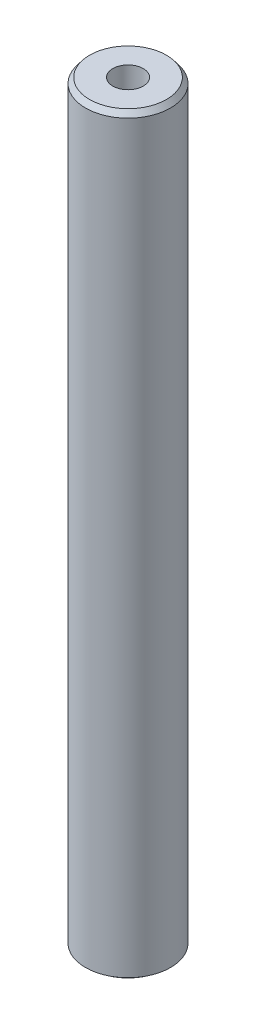
ISO-10303-21;
HEADER;
FILE_DESCRIPTION(('STEP AP214'),'2;1');
FILE_NAME('part.step','',(''),(''),'','','');
FILE_SCHEMA(('AUTOMOTIVE_DESIGN { 1 0 10303 214 1 1 1 1 }'));
ENDSEC;
DATA;
#1=APPLICATION_CONTEXT('core data for automotive mechanical design processes');
#2=APPLICATION_PROTOCOL_DEFINITION('international standard','automotive_design',2000,#1);
#3=PRODUCT_CONTEXT('',#1,'mechanical');
#4=PRODUCT('Part','Part','',(#3));
#5=PRODUCT_RELATED_PRODUCT_CATEGORY('part','',(#4));
#6=PRODUCT_DEFINITION_FORMATION('','',#4);
#7=PRODUCT_DEFINITION_CONTEXT('part definition',#1,'design');
#8=PRODUCT_DEFINITION('design','',#6,#7);
#9=PRODUCT_DEFINITION_SHAPE('','',#8);
#10=(LENGTH_UNIT() NAMED_UNIT(*) SI_UNIT(.MILLI.,.METRE.));
#11=(NAMED_UNIT(*) PLANE_ANGLE_UNIT() SI_UNIT($,.RADIAN.));
#12=(NAMED_UNIT(*) SI_UNIT($,.STERADIAN.) SOLID_ANGLE_UNIT());
#13=UNCERTAINTY_MEASURE_WITH_UNIT(LENGTH_MEASURE(1.E-05),#10,'distance_accuracy_value','');
#14=(GEOMETRIC_REPRESENTATION_CONTEXT(3) GLOBAL_UNCERTAINTY_ASSIGNED_CONTEXT((#13)) GLOBAL_UNIT_ASSIGNED_CONTEXT((#10,
#11,#12)) REPRESENTATION_CONTEXT('',''));
#15=CARTESIAN_POINT('',(0.,0.,0.));
#16=DIRECTION('',(0.,0.,1.));
#17=DIRECTION('',(1.,0.,0.));
#18=AXIS2_PLACEMENT_3D('',#15,#16,#17);
#19=CARTESIAN_POINT('',(0.,310.649268108965,0.));
#20=DIRECTION('',(0.,-1.,0.));
#21=DIRECTION('',(0.,0.,-1.));
#22=AXIS2_PLACEMENT_3D('',#19,#20,#21);
#23=CYLINDRICAL_SURFACE('',#22,17.5);
#24=CARTESIAN_POINT('',(0.,308.43535250962,0.));
#25=DIRECTION('',(0.,1.,0.));
#26=DIRECTION('',(0.,0.,1.));
#27=AXIS2_PLACEMENT_3D('',#24,#25,#26);
#28=CIRCLE('',#27,17.5);
#29=CARTESIAN_POINT('',(0.,308.43535250962,-17.5));
#30=VERTEX_POINT('',#29);
#31=EDGE_CURVE('E50',#30,#30,#28,.F.);
#32=CARTESIAN_POINT('',(0.,1.66145364689391,0.));
#33=DIRECTION('',(0.,1.,0.));
#34=DIRECTION('',(0.,0.,1.));
#35=AXIS2_PLACEMENT_3D('',#32,#33,#34);
#36=CIRCLE('',#35,17.5);
#37=CARTESIAN_POINT('',(0.,1.66145364689391,-17.5));
#38=VERTEX_POINT('',#37);
#39=EDGE_CURVE('E51',#38,#38,#36,.T.);
#40=CARTESIAN_POINT('',(0.,308.43535250962,-17.5));
#41=CARTESIAN_POINT('',(0.,305.239791063133,-17.5));
#42=CARTESIAN_POINT('',(0.,302.044229616646,-17.5));
#43=CARTESIAN_POINT('',(0.,295.653106723673,-17.5));
#44=CARTESIAN_POINT('',(0.,292.457545277186,-17.5));
#45=CARTESIAN_POINT('',(0.,286.066422384213,-17.5));
#46=CARTESIAN_POINT('',(0.,282.870860937726,-17.5));
#47=CARTESIAN_POINT('',(0.,276.479738044752,-17.5));
#48=CARTESIAN_POINT('',(0.,273.284176598266,-17.5));
#49=CARTESIAN_POINT('',(0.,266.893053705292,-17.5));
#50=CARTESIAN_POINT('',(0.,263.697492258805,-17.5));
#51=CARTESIAN_POINT('',(0.,257.306369365832,-17.5));
#52=CARTESIAN_POINT('',(0.,254.110807919345,-17.5));
#53=CARTESIAN_POINT('',(0.,247.719685026372,-17.5));
#54=CARTESIAN_POINT('',(0.,244.524123579885,-17.5));
#55=CARTESIAN_POINT('',(0.,238.133000686912,-17.5));
#56=CARTESIAN_POINT('',(0.,234.937439240425,-17.5));
#57=CARTESIAN_POINT('',(0.,228.546316347452,-17.5));
#58=CARTESIAN_POINT('',(0.,225.350754900965,-17.5));
#59=CARTESIAN_POINT('',(0.,218.959632007991,-17.5));
#60=CARTESIAN_POINT('',(0.,215.764070561505,-17.5));
#61=CARTESIAN_POINT('',(0.,209.372947668531,-17.5));
#62=CARTESIAN_POINT('',(0.,206.177386222044,-17.5));
#63=CARTESIAN_POINT('',(0.,199.786263329071,-17.5));
#64=CARTESIAN_POINT('',(0.,196.590701882584,-17.5));
#65=CARTESIAN_POINT('',(0.,190.199578989611,-17.5));
#66=CARTESIAN_POINT('',(0.,187.004017543124,-17.5));
#67=CARTESIAN_POINT('',(0.,180.612894650151,-17.5));
#68=CARTESIAN_POINT('',(0.,177.417333203664,-17.5));
#69=CARTESIAN_POINT('',(0.,171.02621031069,-17.5));
#70=CARTESIAN_POINT('',(0.,167.830648864204,-17.5));
#71=CARTESIAN_POINT('',(0.,161.43952597123,-17.5));
#72=CARTESIAN_POINT('',(0.,158.243964524744,-17.5));
#73=CARTESIAN_POINT('',(0.,151.85284163177,-17.5));
#74=CARTESIAN_POINT('',(0.,148.657280185283,-17.5));
#75=CARTESIAN_POINT('',(0.,142.26615729231,-17.5));
#76=CARTESIAN_POINT('',(0.,139.070595845823,-17.5));
#77=CARTESIAN_POINT('',(0.,132.67947295285,-17.5));
#78=CARTESIAN_POINT('',(0.,129.483911506363,-17.5));
#79=CARTESIAN_POINT('',(0.,123.09278861339,-17.5));
#80=CARTESIAN_POINT('',(0.,119.897227166903,-17.5));
#81=CARTESIAN_POINT('',(0.,113.506104273929,-17.5));
#82=CARTESIAN_POINT('',(0.,110.310542827443,-17.5));
#83=CARTESIAN_POINT('',(0.,103.919419934469,-17.5));
#84=CARTESIAN_POINT('',(0.,100.723858487982,-17.5));
#85=CARTESIAN_POINT('',(0.,94.332735595009,-17.5));
#86=CARTESIAN_POINT('',(0.,91.1371741485223,-17.5));
#87=CARTESIAN_POINT('',(0.,84.7460512555488,-17.5));
#88=CARTESIAN_POINT('',(0.,81.5504898090621,-17.5));
#89=CARTESIAN_POINT('',(0.,75.1593669160886,-17.5));
#90=CARTESIAN_POINT('',(0.,71.9638054696019,-17.5));
#91=CARTESIAN_POINT('',(0.,65.5726825766285,-17.5));
#92=CARTESIAN_POINT('',(0.,62.3771211301417,-17.5));
#93=CARTESIAN_POINT('',(0.,55.9859982371683,-17.5));
#94=CARTESIAN_POINT('',(0.,52.7904367906816,-17.5));
#95=CARTESIAN_POINT('',(0.,46.3993138977081,-17.5));
#96=CARTESIAN_POINT('',(0.,43.2037524512214,-17.5));
#97=CARTESIAN_POINT('',(0.,36.812629558248,-17.5));
#98=CARTESIAN_POINT('',(0.,33.6170681117612,-17.5));
#99=CARTESIAN_POINT('',(0.,27.2259452187878,-17.5));
#100=CARTESIAN_POINT('',(0.,24.030383772301,-17.5));
#101=CARTESIAN_POINT('',(0.,17.6392608793276,-17.5));
#102=CARTESIAN_POINT('',(0.,14.4436994328408,-17.5));
#103=CARTESIAN_POINT('',(0.,8.05257653986737,-17.5));
#104=CARTESIAN_POINT('',(0.,4.85701509338064,-17.5));
#105=CARTESIAN_POINT('',(0.,1.66145364689391,-17.5));
#106=B_SPLINE_CURVE_WITH_KNOTS('',3,(#40,#41,#42,#43,#44,#45,#46,#47,#48,#49,#50,#51,#52,#53,
#54,#55,#56,#57,#58,#59,#60,#61,#62,#63,#64,#65,#66,#67,#68,#69,#70,#71,#72,#73,#74,#75,#76,#77,
#78,#79,#80,#81,#82,#83,#84,#85,#86,#87,#88,#89,#90,#91,#92,#93,#94,#95,#96,#97,#98,#99,#100,
#101,#102,#103,#104,#105),.UNSPECIFIED.,.F.,.F.,(4,2,2,2,2,2,2,2,2,2,2,2,2,2,2,2,2,2,2,2,2,2,2,
2,2,2,2,2,2,2,2,2,4),(0.,9.5866843394602,19.1733686789204,28.7600530183806,38.3467373578407,
47.9334216973009,57.5201060367611,67.1067903762213,76.6934747156814,86.2801590551416,
95.8668433946018,105.453527734062,115.040212073522,124.626896412982,134.213580752443,
143.800265091903,153.386949431363,162.973633770823,172.560318110283,182.147002449743,
191.733686789204,201.320371128664,210.907055468124,220.493739807584,230.080424147044,
239.667108486505,249.253792825965,258.840477165425,268.427161504885,278.013845844345,
287.600530183805,297.187214523266,306.773898862726),.UNSPECIFIED.);
#107=EDGE_CURVE('BSEAM39',#30,#38,#106,.T.);
#108=ORIENTED_EDGE('',*,*,#31,.T.);
#109=ORIENTED_EDGE('',*,*,#39,.T.);
#110=ORIENTED_EDGE('',*,*,#107,.T.);
#111=ORIENTED_EDGE('',*,*,#107,.F.);
#112=EDGE_LOOP('',(#108,#110,#109,#111));
#113=FACE_BOUND('',#112,.T.);
#114=ADVANCED_FACE('F39',(#113),#23,.T.);
#115=CARTESIAN_POINT('',(0.,310.649268108965,0.));
#116=DIRECTION('',(0.,1.,0.));
#117=DIRECTION('',(0.,0.,1.));
#118=AXIS2_PLACEMENT_3D('',#115,#116,#117);
#119=PLANE('',#118);
#120=CARTESIAN_POINT('',(0.,310.649268108965,0.));
#121=DIRECTION('',(0.,1.,0.));
#122=DIRECTION('',(0.,0.,1.));
#123=AXIS2_PLACEMENT_3D('',#120,#121,#122);
#124=CIRCLE('',#123,15.8385463531065);
#125=CARTESIAN_POINT('',(0.,310.649268108965,15.8385463531065));
#126=VERTEX_POINT('',#125);
#127=EDGE_CURVE('E54',#126,#126,#124,.T.);
#128=ORIENTED_EDGE('',*,*,#127,.T.);
#129=EDGE_LOOP('',(#128));
#130=FACE_BOUND('',#129,.T.);
#131=CARTESIAN_POINT('',(0.,310.649268108965,0.));
#132=DIRECTION('',(0.,1.,0.));
#133=DIRECTION('',(0.,0.,1.));
#134=AXIS2_PLACEMENT_3D('',#131,#132,#133);
#135=CIRCLE('',#134,6.27484759315791);
#136=CARTESIAN_POINT('',(0.,310.649268108965,-6.27484759315791));
#137=VERTEX_POINT('',#136);
#138=EDGE_CURVE('E58',#137,#137,#135,.T.);
#139=ORIENTED_EDGE('',*,*,#138,.F.);
#140=EDGE_LOOP('',(#139));
#141=FACE_BOUND('',#140,.T.);
#142=ADVANCED_FACE('F69',(#130,#141),#119,.T.);
#143=CARTESIAN_POINT('',(0.,0.,0.));
#144=DIRECTION('',(0.,1.,0.));
#145=DIRECTION('',(0.,0.,1.));
#146=AXIS2_PLACEMENT_3D('',#143,#144,#145);
#147=PLANE('',#146);
#148=CARTESIAN_POINT('',(0.,0.,0.));
#149=DIRECTION('',(0.,1.,0.));
#150=DIRECTION('',(0.,0.,1.));
#151=AXIS2_PLACEMENT_3D('',#148,#149,#150);
#152=CIRCLE('',#151,15.2860844006545);
#153=CARTESIAN_POINT('',(0.,0.,15.2860844006545));
#154=VERTEX_POINT('',#153);
#155=EDGE_CURVE('E10',#154,#154,#152,.F.);
#156=ORIENTED_EDGE('',*,*,#155,.T.);
#157=EDGE_LOOP('',(#156));
#158=FACE_BOUND('',#157,.T.);
#159=CARTESIAN_POINT('',(0.,0.,0.));
#160=DIRECTION('',(0.,1.,0.));
#161=DIRECTION('',(0.,0.,1.));
#162=AXIS2_PLACEMENT_3D('',#159,#160,#161);
#163=CIRCLE('',#162,6.27484759315791);
#164=CARTESIAN_POINT('',(0.,0.,-6.27484759315791));
#165=VERTEX_POINT('',#164);
#166=EDGE_CURVE('E63',#165,#165,#163,.T.);
#167=ORIENTED_EDGE('',*,*,#166,.T.);
#168=EDGE_LOOP('',(#167));
#169=FACE_BOUND('',#168,.T.);
#170=ADVANCED_FACE('F75',(#158,#169),#147,.F.);
#171=CARTESIAN_POINT('',(0.,310.649268108965,0.));
#172=DIRECTION('',(0.,-1.,0.));
#173=DIRECTION('',(0.,0.,-1.));
#174=AXIS2_PLACEMENT_3D('',#171,#172,#173);
#175=CYLINDRICAL_SURFACE('',#174,6.27484759315791);
#176=CARTESIAN_POINT('',(0.,310.649268108965,-6.27484759315791));
#177=CARTESIAN_POINT('',(0.,307.41333823283,-6.27484759315791));
#178=CARTESIAN_POINT('',(0.,304.177408356695,-6.27484759315791));
#179=CARTESIAN_POINT('',(0.,297.705548604424,-6.27484759315791));
#180=CARTESIAN_POINT('',(0.,294.469618728289,-6.27484759315791));
#181=CARTESIAN_POINT('',(0.,287.997758976019,-6.27484759315791));
#182=CARTESIAN_POINT('',(0.,284.761829099884,-6.27484759315791));
#183=CARTESIAN_POINT('',(0.,278.289969347614,-6.27484759315791));
#184=CARTESIAN_POINT('',(0.,275.054039471479,-6.27484759315791));
#185=CARTESIAN_POINT('',(0.,268.582179719209,-6.27484759315791));
#186=CARTESIAN_POINT('',(0.,265.346249843074,-6.27484759315791));
#187=CARTESIAN_POINT('',(0.,258.874390090804,-6.27484759315791));
#188=CARTESIAN_POINT('',(0.,255.638460214669,-6.27484759315791));
#189=CARTESIAN_POINT('',(0.,249.166600462399,-6.27484759315791));
#190=CARTESIAN_POINT('',(0.,245.930670586264,-6.27484759315791));
#191=CARTESIAN_POINT('',(0.,239.458810833994,-6.27484759315791));
#192=CARTESIAN_POINT('',(0.,236.222880957859,-6.27484759315791));
#193=CARTESIAN_POINT('',(0.,229.751021205588,-6.27484759315791));
#194=CARTESIAN_POINT('',(0.,226.515091329453,-6.27484759315791));
#195=CARTESIAN_POINT('',(0.,220.043231577183,-6.27484759315791));
#196=CARTESIAN_POINT('',(0.,216.807301701048,-6.27484759315791));
#197=CARTESIAN_POINT('',(0.,210.335441948778,-6.27484759315791));
#198=CARTESIAN_POINT('',(0.,207.099512072643,-6.27484759315791));
#199=CARTESIAN_POINT('',(0.,200.627652320373,-6.27484759315791));
#200=CARTESIAN_POINT('',(0.,197.391722444238,-6.27484759315791));
#201=CARTESIAN_POINT('',(0.,190.919862691968,-6.27484759315791));
#202=CARTESIAN_POINT('',(0.,187.683932815833,-6.27484759315791));
#203=CARTESIAN_POINT('',(0.,181.212073063563,-6.27484759315791));
#204=CARTESIAN_POINT('',(0.,177.976143187428,-6.27484759315791));
#205=CARTESIAN_POINT('',(0.,171.504283435158,-6.27484759315791));
#206=CARTESIAN_POINT('',(0.,168.268353559022,-6.27484759315791));
#207=CARTESIAN_POINT('',(0.,161.796493806752,-6.27484759315791));
#208=CARTESIAN_POINT('',(0.,158.560563930617,-6.27484759315791));
#209=CARTESIAN_POINT('',(0.,152.088704178347,-6.27484759315791));
#210=CARTESIAN_POINT('',(0.,148.852774302212,-6.27484759315791));
#211=CARTESIAN_POINT('',(0.,142.380914549942,-6.27484759315791));
#212=CARTESIAN_POINT('',(0.,139.144984673807,-6.27484759315791));
#213=CARTESIAN_POINT('',(0.,132.673124921537,-6.27484759315791));
#214=CARTESIAN_POINT('',(0.,129.437195045402,-6.27484759315791));
#215=CARTESIAN_POINT('',(0.,122.965335293132,-6.27484759315791));
#216=CARTESIAN_POINT('',(0.,119.729405416997,-6.27484759315791));
#217=CARTESIAN_POINT('',(0.,113.257545664727,-6.27484759315791));
#218=CARTESIAN_POINT('',(0.,110.021615788592,-6.27484759315791));
#219=CARTESIAN_POINT('',(0.,103.549756036321,-6.27484759315791));
#220=CARTESIAN_POINT('',(0.,100.313826160186,-6.27484759315791));
#221=CARTESIAN_POINT('',(0.,93.8419664079163,-6.27484759315791));
#222=CARTESIAN_POINT('',(0.,90.6060365317813,-6.27484759315791));
#223=CARTESIAN_POINT('',(0.,84.1341767795112,-6.27484759315791));
#224=CARTESIAN_POINT('',(0.,80.8982469033761,-6.27484759315791));
#225=CARTESIAN_POINT('',(0.,74.426387151106,-6.27484759315791));
#226=CARTESIAN_POINT('',(0.,71.190457274971,-6.27484759315791));
#227=CARTESIAN_POINT('',(0.,64.7185975227009,-6.27484759315791));
#228=CARTESIAN_POINT('',(0.,61.4826676465659,-6.27484759315791));
#229=CARTESIAN_POINT('',(0.,55.0108078942958,-6.27484759315791));
#230=CARTESIAN_POINT('',(0.,51.7748780181607,-6.27484759315791));
#231=CARTESIAN_POINT('',(0.,45.3030182658907,-6.27484759315791));
#232=CARTESIAN_POINT('',(0.,42.0670883897556,-6.27484759315791));
#233=CARTESIAN_POINT('',(0.,35.5952286374855,-6.27484759315791));
#234=CARTESIAN_POINT('',(0.,32.3592987613504,-6.27484759315791));
#235=CARTESIAN_POINT('',(0.,25.8874390090803,-6.27484759315791));
#236=CARTESIAN_POINT('',(0.,22.6515091329453,-6.27484759315791));
#237=CARTESIAN_POINT('',(0.,16.1796493806752,-6.27484759315791));
#238=CARTESIAN_POINT('',(0.,12.9437195045401,-6.27484759315791));
#239=CARTESIAN_POINT('',(0.,6.47185975227003,-6.27484759315791));
#240=CARTESIAN_POINT('',(0.,3.23592987613499,-6.27484759315791));
#241=CARTESIAN_POINT('',(0.,0.,-6.27484759315791));
#242=B_SPLINE_CURVE_WITH_KNOTS('',3,(#176,#177,#178,#179,#180,#181,#182,#183,#184,#185,#186,
#187,#188,#189,#190,#191,#192,#193,#194,#195,#196,#197,#198,#199,#200,#201,#202,#203,#204,#205,
#206,#207,#208,#209,#210,#211,#212,#213,#214,#215,#216,#217,#218,#219,#220,#221,#222,#223,#224,
#225,#226,#227,#228,#229,#230,#231,#232,#233,#234,#235,#236,#237,#238,#239,#240,#241),
.UNSPECIFIED.,.F.,.F.,(4,2,2,2,2,2,2,2,2,2,2,2,2,2,2,2,2,2,2,2,2,2,2,2,2,2,2,2,2,2,2,2,4),(0.,
9.70778962840518,19.4155792568103,29.1233688852155,38.8311585136206,48.5389481420258,
58.2467377704309,67.9545273988361,77.6623170272412,87.3701066556464,97.0778962840515,
106.785685912457,116.493475540862,126.201265169267,135.909054797672,145.616844426077,
155.324634054482,165.032423682888,174.740213311293,184.448002939698,194.155792568103,
203.863582196508,213.571371824913,223.279161453318,232.986951081724,242.694740710129,
252.402530338534,262.110319966939,271.818109595344,281.525899223749,291.233688852154,
300.94147848056,310.649268108965),.UNSPECIFIED.);
#243=EDGE_CURVE('BSEAM70',#137,#165,#242,.T.);
#244=ORIENTED_EDGE('',*,*,#138,.T.);
#245=ORIENTED_EDGE('',*,*,#166,.F.);
#246=ORIENTED_EDGE('',*,*,#243,.T.);
#247=ORIENTED_EDGE('',*,*,#243,.F.);
#248=EDGE_LOOP('',(#244,#246,#245,#247));
#249=FACE_BOUND('',#248,.T.);
#250=ADVANCED_FACE('F70',(#249),#175,.F.);
#251=CARTESIAN_POINT('',(0.,310.649268108965,0.));
#252=DIRECTION('',(0.,-1.,0.));
#253=DIRECTION('',(0.,0.,-1.));
#254=AXIS2_PLACEMENT_3D('',#251,#252,#253);
#255=CONICAL_SURFACE('',#254,15.8385463531065,0.643795023718335);
#256=ORIENTED_EDGE('',*,*,#31,.F.);
#257=EDGE_LOOP('',(#256));
#258=FACE_BOUND('',#257,.T.);
#259=ORIENTED_EDGE('',*,*,#127,.F.);
#260=EDGE_LOOP('',(#259));
#261=FACE_BOUND('',#260,.T.);
#262=ADVANCED_FACE('F81',(#258,#261),#255,.T.);
#263=CARTESIAN_POINT('',(0.,1.66145364689391,0.));
#264=DIRECTION('',(0.,1.,0.));
#265=DIRECTION('',(0.,0.,1.));
#266=AXIS2_PLACEMENT_3D('',#263,#264,#265);
#267=CONICAL_SURFACE('',#266,17.5,0.927001303076562);
#268=ORIENTED_EDGE('',*,*,#155,.F.);
#269=EDGE_LOOP('',(#268));
#270=FACE_BOUND('',#269,.T.);
#271=ORIENTED_EDGE('',*,*,#39,.F.);
#272=EDGE_LOOP('',(#271));
#273=FACE_BOUND('',#272,.T.);
#274=ADVANCED_FACE('F45',(#270,#273),#267,.T.);
#275=CLOSED_SHELL('',(#114,#142,#170,#250,#262,#274));
#276=MANIFOLD_SOLID_BREP('B2',#275);
#277=ADVANCED_BREP_SHAPE_REPRESENTATION('',(#18,#276),#14);
#278=SHAPE_DEFINITION_REPRESENTATION(#9,#277);
ENDSEC;
END-ISO-10303-21;
